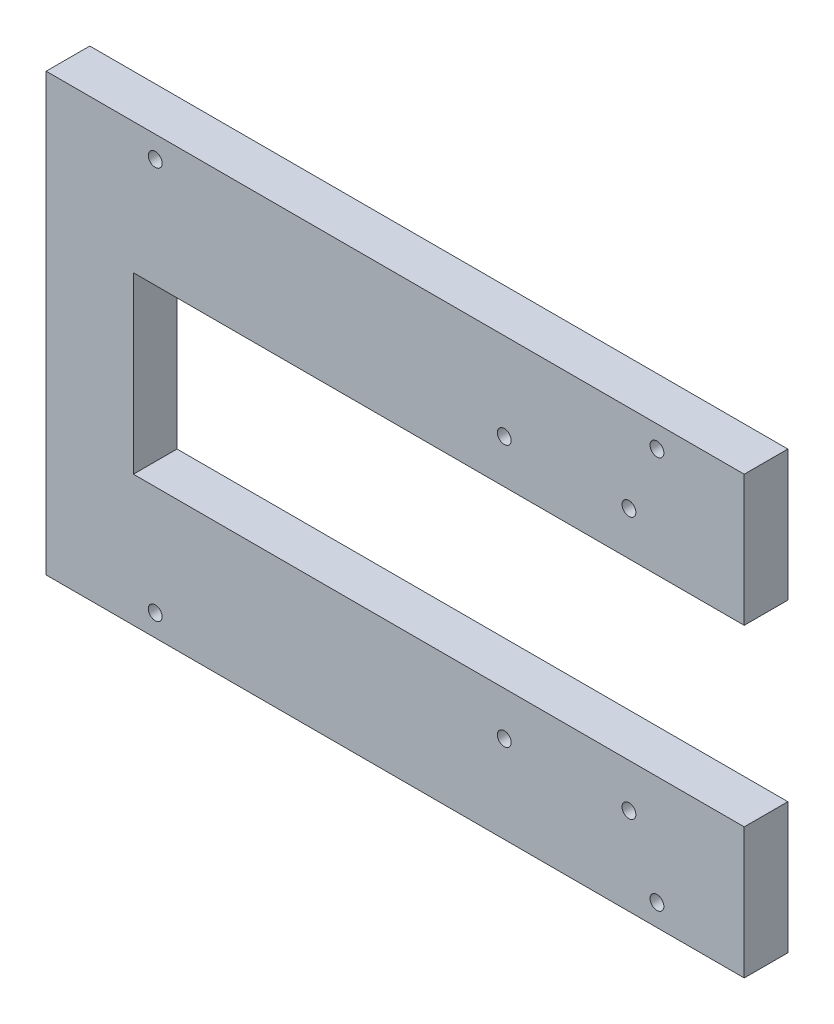
ISO-10303-21;
HEADER;
FILE_DESCRIPTION(('STEP AP214'),'2;1');
FILE_NAME('part.step','',(''),(''),'','','');
FILE_SCHEMA(('AUTOMOTIVE_DESIGN { 1 0 10303 214 1 1 1 1 }'));
ENDSEC;
DATA;
#1=APPLICATION_CONTEXT('core data for automotive mechanical design processes');
#2=APPLICATION_PROTOCOL_DEFINITION('international standard','automotive_design',2000,#1);
#3=PRODUCT_CONTEXT('',#1,'mechanical');
#4=PRODUCT('Part','Part','',(#3));
#5=PRODUCT_RELATED_PRODUCT_CATEGORY('part','',(#4));
#6=PRODUCT_DEFINITION_FORMATION('','',#4);
#7=PRODUCT_DEFINITION_CONTEXT('part definition',#1,'design');
#8=PRODUCT_DEFINITION('design','',#6,#7);
#9=PRODUCT_DEFINITION_SHAPE('','',#8);
#10=(LENGTH_UNIT() NAMED_UNIT(*) SI_UNIT(.MILLI.,.METRE.));
#11=(NAMED_UNIT(*) PLANE_ANGLE_UNIT() SI_UNIT($,.RADIAN.));
#12=(NAMED_UNIT(*) SI_UNIT($,.STERADIAN.) SOLID_ANGLE_UNIT());
#13=UNCERTAINTY_MEASURE_WITH_UNIT(LENGTH_MEASURE(1.E-05),#10,'distance_accuracy_value','');
#14=(GEOMETRIC_REPRESENTATION_CONTEXT(3) GLOBAL_UNCERTAINTY_ASSIGNED_CONTEXT((#13)) GLOBAL_UNIT_ASSIGNED_CONTEXT((#10,
#11,#12)) REPRESENTATION_CONTEXT('',''));
#15=CARTESIAN_POINT('',(0.,0.,0.));
#16=DIRECTION('',(0.,0.,1.));
#17=DIRECTION('',(1.,0.,0.));
#18=AXIS2_PLACEMENT_3D('',#15,#16,#17);
#19=CARTESIAN_POINT('',(0.,0.,10.));
#20=DIRECTION('',(0.,0.,1.));
#21=DIRECTION('',(1.,0.,0.));
#22=AXIS2_PLACEMENT_3D('',#19,#20,#21);
#23=PLANE('',#22);
#24=CARTESIAN_POINT('',(-28.5376237163047,-30.1149813348386,10.));
#25=DIRECTION('',(0.,0.,1.));
#26=DIRECTION('',(1.,0.,0.));
#27=AXIS2_PLACEMENT_3D('',#24,#25,#26);
#28=CIRCLE('',#27,1.5875);
#29=CARTESIAN_POINT('',(-26.9501237163047,-30.1149813348386,10.));
#30=VERTEX_POINT('',#29);
#31=EDGE_CURVE('E212',#30,#30,#28,.T.);
#32=ORIENTED_EDGE('',*,*,#31,.F.);
#33=EDGE_LOOP('',(#32));
#34=FACE_BOUND('',#33,.T.);
#35=CARTESIAN_POINT('',(-28.5376237163047,59.8850186651614,10.));
#36=DIRECTION('',(0.,0.,1.));
#37=DIRECTION('',(1.,0.,0.));
#38=AXIS2_PLACEMENT_3D('',#35,#36,#37);
#39=CIRCLE('',#38,1.5875);
#40=CARTESIAN_POINT('',(-26.9501237163047,59.8850186651614,10.));
#41=VERTEX_POINT('',#40);
#42=EDGE_CURVE('E200',#41,#41,#39,.T.);
#43=ORIENTED_EDGE('',*,*,#42,.F.);
#44=EDGE_LOOP('',(#43));
#45=FACE_BOUND('',#44,.T.);
#46=CARTESIAN_POINT('',(51.4623762836953,-15.1149813348386,10.));
#47=DIRECTION('',(0.,0.,1.));
#48=DIRECTION('',(1.,0.,0.));
#49=AXIS2_PLACEMENT_3D('',#46,#47,#48);
#50=CIRCLE('',#49,1.5875);
#51=CARTESIAN_POINT('',(53.0498762836953,-15.1149813348386,10.));
#52=VERTEX_POINT('',#51);
#53=EDGE_CURVE('E188',#52,#52,#50,.T.);
#54=ORIENTED_EDGE('',*,*,#53,.F.);
#55=EDGE_LOOP('',(#54));
#56=FACE_BOUND('',#55,.T.);
#57=CARTESIAN_POINT('',(51.4623762836953,44.8850186651614,10.));
#58=DIRECTION('',(0.,0.,1.));
#59=DIRECTION('',(1.,0.,0.));
#60=AXIS2_PLACEMENT_3D('',#57,#58,#59);
#61=CIRCLE('',#60,1.5875);
#62=CARTESIAN_POINT('',(53.0498762836953,44.8850186651614,10.));
#63=VERTEX_POINT('',#62);
#64=EDGE_CURVE('E134',#63,#63,#61,.T.);
#65=ORIENTED_EDGE('',*,*,#64,.F.);
#66=EDGE_LOOP('',(#65));
#67=FACE_BOUND('',#66,.T.);
#68=DIRECTION('',(0.,-1.,0.));
#69=VECTOR('',#68,1.);
#70=CARTESIAN_POINT('',(-53.5376237163047,64.8850186651614,10.));
#71=LINE('',#70,#69);
#72=CARTESIAN_POINT('',(-53.5376237163047,64.8850186651614,10.));
#73=VERTEX_POINT('',#72);
#74=CARTESIAN_POINT('',(-53.5376237163047,-35.1149813348386,10.));
#75=VERTEX_POINT('',#74);
#76=EDGE_CURVE('E145',#73,#75,#71,.T.);
#77=ORIENTED_EDGE('',*,*,#76,.T.);
#78=DIRECTION('',(1.,0.,0.));
#79=VECTOR('',#78,1.);
#80=CARTESIAN_POINT('',(-53.5376237163047,-35.1149813348386,10.));
#81=LINE('',#80,#79);
#82=CARTESIAN_POINT('',(106.462376283695,-35.1149813348386,10.));
#83=VERTEX_POINT('',#82);
#84=EDGE_CURVE('E93',#75,#83,#81,.T.);
#85=ORIENTED_EDGE('',*,*,#84,.T.);
#86=DIRECTION('',(0.,1.,0.));
#87=VECTOR('',#86,1.);
#88=CARTESIAN_POINT('',(106.462376283695,-35.1149813348386,10.));
#89=LINE('',#88,#87);
#90=CARTESIAN_POINT('',(106.462376283695,-5.1149813348386,10.));
#91=VERTEX_POINT('',#90);
#92=EDGE_CURVE('E160',#83,#91,#89,.T.);
#93=ORIENTED_EDGE('',*,*,#92,.T.);
#94=DIRECTION('',(-1.,0.,0.));
#95=VECTOR('',#94,1.);
#96=CARTESIAN_POINT('',(106.462376283695,-5.1149813348386,10.));
#97=LINE('',#96,#95);
#98=CARTESIAN_POINT('',(-33.5376237163047,-5.11498133483861,10.));
#99=VERTEX_POINT('',#98);
#100=EDGE_CURVE('E173',#91,#99,#97,.T.);
#101=ORIENTED_EDGE('',*,*,#100,.T.);
#102=DIRECTION('',(0.,1.,0.));
#103=VECTOR('',#102,1.);
#104=CARTESIAN_POINT('',(-33.5376237163047,34.8850186651614,10.));
#105=LINE('',#104,#103);
#106=CARTESIAN_POINT('',(-33.5376237163047,34.8850186651614,10.));
#107=VERTEX_POINT('',#106);
#108=EDGE_CURVE('E112',#99,#107,#105,.T.);
#109=ORIENTED_EDGE('',*,*,#108,.T.);
#110=DIRECTION('',(1.,0.,0.));
#111=VECTOR('',#110,1.);
#112=CARTESIAN_POINT('',(106.462376283695,34.8850186651614,10.));
#113=LINE('',#112,#111);
#114=CARTESIAN_POINT('',(106.462376283695,34.8850186651614,10.));
#115=VERTEX_POINT('',#114);
#116=EDGE_CURVE('E106',#107,#115,#113,.T.);
#117=ORIENTED_EDGE('',*,*,#116,.T.);
#118=DIRECTION('',(0.,1.,0.));
#119=VECTOR('',#118,1.);
#120=CARTESIAN_POINT('',(106.462376283695,64.8850186651614,10.));
#121=LINE('',#120,#119);
#122=CARTESIAN_POINT('',(106.462376283695,64.8850186651614,10.));
#123=VERTEX_POINT('',#122);
#124=EDGE_CURVE('E110',#115,#123,#121,.T.);
#125=ORIENTED_EDGE('',*,*,#124,.T.);
#126=DIRECTION('',(-1.,0.,0.));
#127=VECTOR('',#126,1.);
#128=CARTESIAN_POINT('',(-53.5376237163047,64.8850186651614,10.));
#129=LINE('',#128,#127);
#130=EDGE_CURVE('E50',#123,#73,#129,.T.);
#131=ORIENTED_EDGE('',*,*,#130,.T.);
#132=EDGE_LOOP('',(#77,#85,#93,#101,#109,#117,#125,#131));
#133=FACE_BOUND('',#132,.T.);
#134=CARTESIAN_POINT('',(80.0373762836953,44.8850186651615,10.));
#135=DIRECTION('',(0.,0.,1.));
#136=DIRECTION('',(1.,0.,0.));
#137=AXIS2_PLACEMENT_3D('',#134,#135,#136);
#138=CIRCLE('',#137,1.5875);
#139=CARTESIAN_POINT('',(81.6248762836953,44.8850186651615,10.));
#140=VERTEX_POINT('',#139);
#141=EDGE_CURVE('E182',#140,#140,#138,.T.);
#142=ORIENTED_EDGE('',*,*,#141,.F.);
#143=EDGE_LOOP('',(#142));
#144=FACE_BOUND('',#143,.T.);
#145=CARTESIAN_POINT('',(80.0373762836953,-15.1149813348386,10.));
#146=DIRECTION('',(0.,0.,1.));
#147=DIRECTION('',(1.,0.,0.));
#148=AXIS2_PLACEMENT_3D('',#145,#146,#147);
#149=CIRCLE('',#148,1.5875);
#150=CARTESIAN_POINT('',(81.6248762836953,-15.1149813348386,10.));
#151=VERTEX_POINT('',#150);
#152=EDGE_CURVE('E194',#151,#151,#149,.T.);
#153=ORIENTED_EDGE('',*,*,#152,.F.);
#154=EDGE_LOOP('',(#153));
#155=FACE_BOUND('',#154,.T.);
#156=CARTESIAN_POINT('',(86.4623762836953,59.8850186651614,10.));
#157=DIRECTION('',(0.,0.,1.));
#158=DIRECTION('',(1.,0.,0.));
#159=AXIS2_PLACEMENT_3D('',#156,#157,#158);
#160=CIRCLE('',#159,1.5875);
#161=CARTESIAN_POINT('',(88.0498762836953,59.8850186651614,10.));
#162=VERTEX_POINT('',#161);
#163=EDGE_CURVE('E206',#162,#162,#160,.T.);
#164=ORIENTED_EDGE('',*,*,#163,.F.);
#165=EDGE_LOOP('',(#164));
#166=FACE_BOUND('',#165,.T.);
#167=CARTESIAN_POINT('',(86.4623762836953,-30.1149813348386,10.));
#168=DIRECTION('',(0.,0.,1.));
#169=DIRECTION('',(1.,0.,0.));
#170=AXIS2_PLACEMENT_3D('',#167,#168,#169);
#171=CIRCLE('',#170,1.5875);
#172=CARTESIAN_POINT('',(88.0498762836953,-30.1149813348386,10.));
#173=VERTEX_POINT('',#172);
#174=EDGE_CURVE('E218',#173,#173,#171,.T.);
#175=ORIENTED_EDGE('',*,*,#174,.F.);
#176=EDGE_LOOP('',(#175));
#177=FACE_BOUND('',#176,.T.);
#178=ADVANCED_FACE('F33',(#34,#45,#56,#67,#133,#144,#155,#166,#177),#23,.T.);
#179=CARTESIAN_POINT('',(0.,0.,0.));
#180=DIRECTION('',(0.,0.,1.));
#181=DIRECTION('',(1.,0.,0.));
#182=AXIS2_PLACEMENT_3D('',#179,#180,#181);
#183=PLANE('',#182);
#184=CARTESIAN_POINT('',(-28.5376237163047,-30.1149813348386,0.));
#185=DIRECTION('',(0.,0.,1.));
#186=DIRECTION('',(1.,0.,0.));
#187=AXIS2_PLACEMENT_3D('',#184,#185,#186);
#188=CIRCLE('',#187,1.5875);
#189=CARTESIAN_POINT('',(-26.9501237163047,-30.1149813348386,0.));
#190=VERTEX_POINT('',#189);
#191=EDGE_CURVE('E215',#190,#190,#188,.T.);
#192=ORIENTED_EDGE('',*,*,#191,.T.);
#193=EDGE_LOOP('',(#192));
#194=FACE_BOUND('',#193,.T.);
#195=CARTESIAN_POINT('',(-28.5376237163047,59.8850186651614,0.));
#196=DIRECTION('',(0.,0.,1.));
#197=DIRECTION('',(1.,0.,0.));
#198=AXIS2_PLACEMENT_3D('',#195,#196,#197);
#199=CIRCLE('',#198,1.5875);
#200=CARTESIAN_POINT('',(-26.9501237163047,59.8850186651614,0.));
#201=VERTEX_POINT('',#200);
#202=EDGE_CURVE('E203',#201,#201,#199,.T.);
#203=ORIENTED_EDGE('',*,*,#202,.T.);
#204=EDGE_LOOP('',(#203));
#205=FACE_BOUND('',#204,.T.);
#206=CARTESIAN_POINT('',(51.4623762836953,-15.1149813348386,0.));
#207=DIRECTION('',(0.,0.,1.));
#208=DIRECTION('',(1.,0.,0.));
#209=AXIS2_PLACEMENT_3D('',#206,#207,#208);
#210=CIRCLE('',#209,1.5875);
#211=CARTESIAN_POINT('',(53.0498762836953,-15.1149813348386,0.));
#212=VERTEX_POINT('',#211);
#213=EDGE_CURVE('E191',#212,#212,#210,.T.);
#214=ORIENTED_EDGE('',*,*,#213,.T.);
#215=EDGE_LOOP('',(#214));
#216=FACE_BOUND('',#215,.T.);
#217=CARTESIAN_POINT('',(51.4623762836953,44.8850186651614,0.));
#218=DIRECTION('',(0.,0.,1.));
#219=DIRECTION('',(1.,0.,0.));
#220=AXIS2_PLACEMENT_3D('',#217,#218,#219);
#221=CIRCLE('',#220,1.5875);
#222=CARTESIAN_POINT('',(53.0498762836953,44.8850186651614,0.));
#223=VERTEX_POINT('',#222);
#224=EDGE_CURVE('E179',#223,#223,#221,.T.);
#225=ORIENTED_EDGE('',*,*,#224,.T.);
#226=EDGE_LOOP('',(#225));
#227=FACE_BOUND('',#226,.T.);
#228=DIRECTION('',(0.,-1.,0.));
#229=VECTOR('',#228,1.);
#230=CARTESIAN_POINT('',(-53.5376237163047,64.8850186651614,0.));
#231=LINE('',#230,#229);
#232=CARTESIAN_POINT('',(-53.5376237163047,64.8850186651614,0.));
#233=VERTEX_POINT('',#232);
#234=CARTESIAN_POINT('',(-53.5376237163047,-35.1149813348386,0.));
#235=VERTEX_POINT('',#234);
#236=EDGE_CURVE('E130',#233,#235,#231,.T.);
#237=ORIENTED_EDGE('',*,*,#236,.F.);
#238=DIRECTION('',(-1.,0.,0.));
#239=VECTOR('',#238,1.);
#240=CARTESIAN_POINT('',(-53.5376237163047,64.8850186651614,0.));
#241=LINE('',#240,#239);
#242=CARTESIAN_POINT('',(106.462376283695,64.8850186651614,0.));
#243=VERTEX_POINT('',#242);
#244=EDGE_CURVE('E85',#243,#233,#241,.T.);
#245=ORIENTED_EDGE('',*,*,#244,.F.);
#246=DIRECTION('',(0.,1.,0.));
#247=VECTOR('',#246,1.);
#248=CARTESIAN_POINT('',(106.462376283695,64.8850186651614,0.));
#249=LINE('',#248,#247);
#250=CARTESIAN_POINT('',(106.462376283695,34.8850186651614,0.));
#251=VERTEX_POINT('',#250);
#252=EDGE_CURVE('E79',#251,#243,#249,.T.);
#253=ORIENTED_EDGE('',*,*,#252,.F.);
#254=DIRECTION('',(1.,0.,0.));
#255=VECTOR('',#254,1.);
#256=CARTESIAN_POINT('',(106.462376283695,34.8850186651614,0.));
#257=LINE('',#256,#255);
#258=CARTESIAN_POINT('',(-33.5376237163047,34.8850186651614,0.));
#259=VERTEX_POINT('',#258);
#260=EDGE_CURVE('E120',#259,#251,#257,.T.);
#261=ORIENTED_EDGE('',*,*,#260,.F.);
#262=DIRECTION('',(0.,1.,0.));
#263=VECTOR('',#262,1.);
#264=CARTESIAN_POINT('',(-33.5376237163047,34.8850186651614,0.));
#265=LINE('',#264,#263);
#266=CARTESIAN_POINT('',(-33.5376237163047,-5.11498133483861,0.));
#267=VERTEX_POINT('',#266);
#268=EDGE_CURVE('E140',#267,#259,#265,.T.);
#269=ORIENTED_EDGE('',*,*,#268,.F.);
#270=DIRECTION('',(-1.,0.,0.));
#271=VECTOR('',#270,1.);
#272=CARTESIAN_POINT('',(106.462376283695,-5.1149813348386,0.));
#273=LINE('',#272,#271);
#274=CARTESIAN_POINT('',(106.462376283695,-5.1149813348386,0.));
#275=VERTEX_POINT('',#274);
#276=EDGE_CURVE('E138',#275,#267,#273,.T.);
#277=ORIENTED_EDGE('',*,*,#276,.F.);
#278=DIRECTION('',(0.,1.,0.));
#279=VECTOR('',#278,1.);
#280=CARTESIAN_POINT('',(106.462376283695,-35.1149813348386,0.));
#281=LINE('',#280,#279);
#282=CARTESIAN_POINT('',(106.462376283695,-35.1149813348386,0.));
#283=VERTEX_POINT('',#282);
#284=EDGE_CURVE('E136',#283,#275,#281,.T.);
#285=ORIENTED_EDGE('',*,*,#284,.F.);
#286=DIRECTION('',(1.,0.,0.));
#287=VECTOR('',#286,1.);
#288=CARTESIAN_POINT('',(-53.5376237163047,-35.1149813348386,0.));
#289=LINE('',#288,#287);
#290=EDGE_CURVE('E133',#235,#283,#289,.T.);
#291=ORIENTED_EDGE('',*,*,#290,.F.);
#292=EDGE_LOOP('',(#237,#245,#253,#261,#269,#277,#285,#291));
#293=FACE_BOUND('',#292,.T.);
#294=CARTESIAN_POINT('',(80.0373762836953,44.8850186651615,0.));
#295=DIRECTION('',(0.,0.,1.));
#296=DIRECTION('',(1.,0.,0.));
#297=AXIS2_PLACEMENT_3D('',#294,#295,#296);
#298=CIRCLE('',#297,1.5875);
#299=CARTESIAN_POINT('',(81.6248762836953,44.8850186651615,0.));
#300=VERTEX_POINT('',#299);
#301=EDGE_CURVE('E185',#300,#300,#298,.T.);
#302=ORIENTED_EDGE('',*,*,#301,.T.);
#303=EDGE_LOOP('',(#302));
#304=FACE_BOUND('',#303,.T.);
#305=CARTESIAN_POINT('',(80.0373762836953,-15.1149813348386,0.));
#306=DIRECTION('',(0.,0.,1.));
#307=DIRECTION('',(1.,0.,0.));
#308=AXIS2_PLACEMENT_3D('',#305,#306,#307);
#309=CIRCLE('',#308,1.5875);
#310=CARTESIAN_POINT('',(81.6248762836953,-15.1149813348386,0.));
#311=VERTEX_POINT('',#310);
#312=EDGE_CURVE('E197',#311,#311,#309,.T.);
#313=ORIENTED_EDGE('',*,*,#312,.T.);
#314=EDGE_LOOP('',(#313));
#315=FACE_BOUND('',#314,.T.);
#316=CARTESIAN_POINT('',(86.4623762836953,59.8850186651614,0.));
#317=DIRECTION('',(0.,0.,1.));
#318=DIRECTION('',(1.,0.,0.));
#319=AXIS2_PLACEMENT_3D('',#316,#317,#318);
#320=CIRCLE('',#319,1.5875);
#321=CARTESIAN_POINT('',(88.0498762836953,59.8850186651614,0.));
#322=VERTEX_POINT('',#321);
#323=EDGE_CURVE('E209',#322,#322,#320,.T.);
#324=ORIENTED_EDGE('',*,*,#323,.T.);
#325=EDGE_LOOP('',(#324));
#326=FACE_BOUND('',#325,.T.);
#327=CARTESIAN_POINT('',(86.4623762836953,-30.1149813348386,0.));
#328=DIRECTION('',(0.,0.,1.));
#329=DIRECTION('',(1.,0.,0.));
#330=AXIS2_PLACEMENT_3D('',#327,#328,#329);
#331=CIRCLE('',#330,1.5875);
#332=CARTESIAN_POINT('',(88.0498762836953,-30.1149813348386,0.));
#333=VERTEX_POINT('',#332);
#334=EDGE_CURVE('E221',#333,#333,#331,.T.);
#335=ORIENTED_EDGE('',*,*,#334,.T.);
#336=EDGE_LOOP('',(#335));
#337=FACE_BOUND('',#336,.T.);
#338=ADVANCED_FACE('F164',(#194,#205,#216,#227,#293,#304,#315,#326,#337),#183,.F.);
#339=CARTESIAN_POINT('',(-53.5376237163047,64.8850186651614,10.));
#340=DIRECTION('',(1.,0.,0.));
#341=DIRECTION('',(0.,1.,0.));
#342=AXIS2_PLACEMENT_3D('',#339,#340,#341);
#343=PLANE('',#342);
#344=ORIENTED_EDGE('',*,*,#236,.T.);
#345=DIRECTION('',(0.,0.,-1.));
#346=VECTOR('',#345,1.);
#347=CARTESIAN_POINT('',(-53.5376237163047,-35.1149813348386,10.));
#348=LINE('',#347,#346);
#349=EDGE_CURVE('E11',#75,#235,#348,.T.);
#350=ORIENTED_EDGE('',*,*,#349,.F.);
#351=ORIENTED_EDGE('',*,*,#76,.F.);
#352=DIRECTION('',(0.,0.,-1.));
#353=VECTOR('',#352,1.);
#354=CARTESIAN_POINT('',(-53.5376237163047,64.8850186651614,10.));
#355=LINE('',#354,#353);
#356=EDGE_CURVE('E126',#73,#233,#355,.T.);
#357=ORIENTED_EDGE('',*,*,#356,.T.);
#358=EDGE_LOOP('',(#344,#350,#351,#357));
#359=FACE_BOUND('',#358,.T.);
#360=ADVANCED_FACE('F35',(#359),#343,.F.);
#361=CARTESIAN_POINT('',(-53.5376237163047,-35.1149813348386,10.));
#362=DIRECTION('',(0.,1.,0.));
#363=DIRECTION('',(-1.,0.,0.));
#364=AXIS2_PLACEMENT_3D('',#361,#362,#363);
#365=PLANE('',#364);
#366=ORIENTED_EDGE('',*,*,#290,.T.);
#367=DIRECTION('',(0.,0.,-1.));
#368=VECTOR('',#367,1.);
#369=CARTESIAN_POINT('',(106.462376283695,-35.1149813348386,10.));
#370=LINE('',#369,#368);
#371=EDGE_CURVE('E42',#83,#283,#370,.T.);
#372=ORIENTED_EDGE('',*,*,#371,.F.);
#373=ORIENTED_EDGE('',*,*,#84,.F.);
#374=ORIENTED_EDGE('',*,*,#349,.T.);
#375=EDGE_LOOP('',(#366,#372,#373,#374));
#376=FACE_BOUND('',#375,.T.);
#377=ADVANCED_FACE('F256',(#376),#365,.F.);
#378=CARTESIAN_POINT('',(106.462376283695,-35.1149813348386,10.));
#379=DIRECTION('',(-1.,0.,0.));
#380=DIRECTION('',(0.,-1.,0.));
#381=AXIS2_PLACEMENT_3D('',#378,#379,#380);
#382=PLANE('',#381);
#383=ORIENTED_EDGE('',*,*,#284,.T.);
#384=DIRECTION('',(0.,0.,-1.));
#385=VECTOR('',#384,1.);
#386=CARTESIAN_POINT('',(106.462376283695,-5.1149813348386,10.));
#387=LINE('',#386,#385);
#388=EDGE_CURVE('E152',#91,#275,#387,.T.);
#389=ORIENTED_EDGE('',*,*,#388,.F.);
#390=ORIENTED_EDGE('',*,*,#92,.F.);
#391=ORIENTED_EDGE('',*,*,#371,.T.);
#392=EDGE_LOOP('',(#383,#389,#390,#391));
#393=FACE_BOUND('',#392,.T.);
#394=ADVANCED_FACE('F158',(#393),#382,.F.);
#395=CARTESIAN_POINT('',(106.462376283695,-5.1149813348386,10.));
#396=DIRECTION('',(0.,-1.,0.));
#397=DIRECTION('',(1.,0.,0.));
#398=AXIS2_PLACEMENT_3D('',#395,#396,#397);
#399=PLANE('',#398);
#400=ORIENTED_EDGE('',*,*,#276,.T.);
#401=DIRECTION('',(0.,0.,-1.));
#402=VECTOR('',#401,1.);
#403=CARTESIAN_POINT('',(-33.5376237163047,-5.11498133483861,10.));
#404=LINE('',#403,#402);
#405=EDGE_CURVE('E149',#99,#267,#404,.T.);
#406=ORIENTED_EDGE('',*,*,#405,.F.);
#407=ORIENTED_EDGE('',*,*,#100,.F.);
#408=ORIENTED_EDGE('',*,*,#388,.T.);
#409=EDGE_LOOP('',(#400,#406,#407,#408));
#410=FACE_BOUND('',#409,.T.);
#411=ADVANCED_FACE('F169',(#410),#399,.F.);
#412=CARTESIAN_POINT('',(-33.5376237163047,34.8850186651614,10.));
#413=DIRECTION('',(-1.,0.,0.));
#414=DIRECTION('',(0.,-1.,0.));
#415=AXIS2_PLACEMENT_3D('',#412,#413,#414);
#416=PLANE('',#415);
#417=ORIENTED_EDGE('',*,*,#268,.T.);
#418=DIRECTION('',(0.,0.,-1.));
#419=VECTOR('',#418,1.);
#420=CARTESIAN_POINT('',(-33.5376237163047,34.8850186651614,10.));
#421=LINE('',#420,#419);
#422=EDGE_CURVE('E121',#107,#259,#421,.T.);
#423=ORIENTED_EDGE('',*,*,#422,.F.);
#424=ORIENTED_EDGE('',*,*,#108,.F.);
#425=ORIENTED_EDGE('',*,*,#405,.T.);
#426=EDGE_LOOP('',(#417,#423,#424,#425));
#427=FACE_BOUND('',#426,.T.);
#428=ADVANCED_FACE('F172',(#427),#416,.F.);
#429=CARTESIAN_POINT('',(106.462376283695,34.8850186651614,10.));
#430=DIRECTION('',(0.,1.,0.));
#431=DIRECTION('',(-1.,0.,0.));
#432=AXIS2_PLACEMENT_3D('',#429,#430,#431);
#433=PLANE('',#432);
#434=ORIENTED_EDGE('',*,*,#260,.T.);
#435=DIRECTION('',(0.,0.,-1.));
#436=VECTOR('',#435,1.);
#437=CARTESIAN_POINT('',(106.462376283695,34.8850186651614,10.));
#438=LINE('',#437,#436);
#439=EDGE_CURVE('E117',#115,#251,#438,.T.);
#440=ORIENTED_EDGE('',*,*,#439,.F.);
#441=ORIENTED_EDGE('',*,*,#116,.F.);
#442=ORIENTED_EDGE('',*,*,#422,.T.);
#443=EDGE_LOOP('',(#434,#440,#441,#442));
#444=FACE_BOUND('',#443,.T.);
#445=ADVANCED_FACE('F118',(#444),#433,.F.);
#446=CARTESIAN_POINT('',(106.462376283695,64.8850186651614,10.));
#447=DIRECTION('',(-1.,0.,0.));
#448=DIRECTION('',(0.,-1.,0.));
#449=AXIS2_PLACEMENT_3D('',#446,#447,#448);
#450=PLANE('',#449);
#451=ORIENTED_EDGE('',*,*,#252,.T.);
#452=DIRECTION('',(0.,0.,-1.));
#453=VECTOR('',#452,1.);
#454=CARTESIAN_POINT('',(106.462376283695,64.8850186651614,10.));
#455=LINE('',#454,#453);
#456=EDGE_CURVE('E122',#123,#243,#455,.T.);
#457=ORIENTED_EDGE('',*,*,#456,.F.);
#458=ORIENTED_EDGE('',*,*,#124,.F.);
#459=ORIENTED_EDGE('',*,*,#439,.T.);
#460=EDGE_LOOP('',(#451,#457,#458,#459));
#461=FACE_BOUND('',#460,.T.);
#462=ADVANCED_FACE('F124',(#461),#450,.F.);
#463=CARTESIAN_POINT('',(-53.5376237163047,64.8850186651614,10.));
#464=DIRECTION('',(0.,-1.,0.));
#465=DIRECTION('',(1.,0.,0.));
#466=AXIS2_PLACEMENT_3D('',#463,#464,#465);
#467=PLANE('',#466);
#468=ORIENTED_EDGE('',*,*,#244,.T.);
#469=ORIENTED_EDGE('',*,*,#356,.F.);
#470=ORIENTED_EDGE('',*,*,#130,.F.);
#471=ORIENTED_EDGE('',*,*,#456,.T.);
#472=EDGE_LOOP('',(#468,#469,#470,#471));
#473=FACE_BOUND('',#472,.T.);
#474=ADVANCED_FACE('F244',(#473),#467,.F.);
#475=CARTESIAN_POINT('',(51.4623762836953,44.8850186651614,10.));
#476=DIRECTION('',(0.,0.,-1.));
#477=DIRECTION('',(-1.,0.,0.));
#478=AXIS2_PLACEMENT_3D('',#475,#476,#477);
#479=CYLINDRICAL_SURFACE('',#478,1.5875);
#480=ORIENTED_EDGE('',*,*,#64,.T.);
#481=EDGE_LOOP('',(#480));
#482=FACE_BOUND('',#481,.T.);
#483=ORIENTED_EDGE('',*,*,#224,.F.);
#484=EDGE_LOOP('',(#483));
#485=FACE_BOUND('',#484,.T.);
#486=ADVANCED_FACE('F241',(#482,#485),#479,.F.);
#487=CARTESIAN_POINT('',(80.0373762836953,44.8850186651615,10.));
#488=DIRECTION('',(0.,0.,-1.));
#489=DIRECTION('',(-1.,0.,0.));
#490=AXIS2_PLACEMENT_3D('',#487,#488,#489);
#491=CYLINDRICAL_SURFACE('',#490,1.5875);
#492=ORIENTED_EDGE('',*,*,#141,.T.);
#493=EDGE_LOOP('',(#492));
#494=FACE_BOUND('',#493,.T.);
#495=ORIENTED_EDGE('',*,*,#301,.F.);
#496=EDGE_LOOP('',(#495));
#497=FACE_BOUND('',#496,.T.);
#498=ADVANCED_FACE('F320',(#494,#497),#491,.F.);
#499=CARTESIAN_POINT('',(51.4623762836953,-15.1149813348386,10.));
#500=DIRECTION('',(0.,0.,-1.));
#501=DIRECTION('',(-1.,0.,0.));
#502=AXIS2_PLACEMENT_3D('',#499,#500,#501);
#503=CYLINDRICAL_SURFACE('',#502,1.5875);
#504=ORIENTED_EDGE('',*,*,#53,.T.);
#505=EDGE_LOOP('',(#504));
#506=FACE_BOUND('',#505,.T.);
#507=ORIENTED_EDGE('',*,*,#213,.F.);
#508=EDGE_LOOP('',(#507));
#509=FACE_BOUND('',#508,.T.);
#510=ADVANCED_FACE('F328',(#506,#509),#503,.F.);
#511=CARTESIAN_POINT('',(80.0373762836953,-15.1149813348386,10.));
#512=DIRECTION('',(0.,0.,-1.));
#513=DIRECTION('',(-1.,0.,0.));
#514=AXIS2_PLACEMENT_3D('',#511,#512,#513);
#515=CYLINDRICAL_SURFACE('',#514,1.5875);
#516=ORIENTED_EDGE('',*,*,#152,.T.);
#517=EDGE_LOOP('',(#516));
#518=FACE_BOUND('',#517,.T.);
#519=ORIENTED_EDGE('',*,*,#312,.F.);
#520=EDGE_LOOP('',(#519));
#521=FACE_BOUND('',#520,.T.);
#522=ADVANCED_FACE('F336',(#518,#521),#515,.F.);
#523=CARTESIAN_POINT('',(-28.5376237163047,59.8850186651614,10.));
#524=DIRECTION('',(0.,0.,-1.));
#525=DIRECTION('',(-1.,0.,0.));
#526=AXIS2_PLACEMENT_3D('',#523,#524,#525);
#527=CYLINDRICAL_SURFACE('',#526,1.5875);
#528=ORIENTED_EDGE('',*,*,#42,.T.);
#529=EDGE_LOOP('',(#528));
#530=FACE_BOUND('',#529,.T.);
#531=ORIENTED_EDGE('',*,*,#202,.F.);
#532=EDGE_LOOP('',(#531));
#533=FACE_BOUND('',#532,.T.);
#534=ADVANCED_FACE('F345',(#530,#533),#527,.F.);
#535=CARTESIAN_POINT('',(86.4623762836953,59.8850186651614,10.));
#536=DIRECTION('',(0.,0.,-1.));
#537=DIRECTION('',(-1.,0.,0.));
#538=AXIS2_PLACEMENT_3D('',#535,#536,#537);
#539=CYLINDRICAL_SURFACE('',#538,1.5875);
#540=ORIENTED_EDGE('',*,*,#163,.T.);
#541=EDGE_LOOP('',(#540));
#542=FACE_BOUND('',#541,.T.);
#543=ORIENTED_EDGE('',*,*,#323,.F.);
#544=EDGE_LOOP('',(#543));
#545=FACE_BOUND('',#544,.T.);
#546=ADVANCED_FACE('F354',(#542,#545),#539,.F.);
#547=CARTESIAN_POINT('',(-28.5376237163047,-30.1149813348386,10.));
#548=DIRECTION('',(0.,0.,-1.));
#549=DIRECTION('',(-1.,0.,0.));
#550=AXIS2_PLACEMENT_3D('',#547,#548,#549);
#551=CYLINDRICAL_SURFACE('',#550,1.5875);
#552=ORIENTED_EDGE('',*,*,#31,.T.);
#553=EDGE_LOOP('',(#552));
#554=FACE_BOUND('',#553,.T.);
#555=ORIENTED_EDGE('',*,*,#191,.F.);
#556=EDGE_LOOP('',(#555));
#557=FACE_BOUND('',#556,.T.);
#558=ADVANCED_FACE('F363',(#554,#557),#551,.F.);
#559=CARTESIAN_POINT('',(86.4623762836953,-30.1149813348386,10.));
#560=DIRECTION('',(0.,0.,-1.));
#561=DIRECTION('',(-1.,0.,0.));
#562=AXIS2_PLACEMENT_3D('',#559,#560,#561);
#563=CYLINDRICAL_SURFACE('',#562,1.5875);
#564=ORIENTED_EDGE('',*,*,#174,.T.);
#565=EDGE_LOOP('',(#564));
#566=FACE_BOUND('',#565,.T.);
#567=ORIENTED_EDGE('',*,*,#334,.F.);
#568=EDGE_LOOP('',(#567));
#569=FACE_BOUND('',#568,.T.);
#570=ADVANCED_FACE('F227',(#566,#569),#563,.F.);
#571=CLOSED_SHELL('',(#178,#338,#360,#377,#394,#411,#428,#445,#462,#474,#486,#498,#510,#522,
#534,#546,#558,#570));
#572=MANIFOLD_SOLID_BREP('B2',#571);
#573=ADVANCED_BREP_SHAPE_REPRESENTATION('',(#18,#572),#14);
#574=SHAPE_DEFINITION_REPRESENTATION(#9,#573);
ENDSEC;
END-ISO-10303-21;
